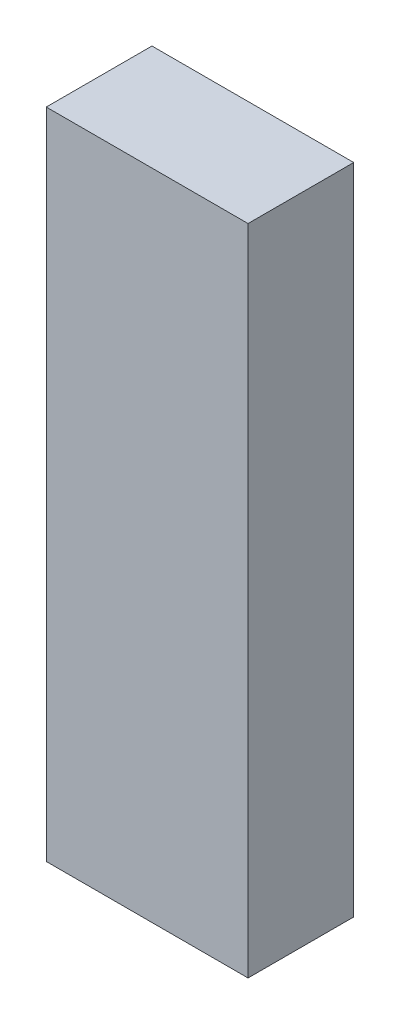
ISO-10303-21;
HEADER;
FILE_DESCRIPTION(('STEP AP214'),'2;1');
FILE_NAME('part.step','',(''),(''),'','','');
FILE_SCHEMA(('AUTOMOTIVE_DESIGN { 1 0 10303 214 1 1 1 1 }'));
ENDSEC;
DATA;
#1=APPLICATION_CONTEXT('core data for automotive mechanical design processes');
#2=APPLICATION_PROTOCOL_DEFINITION('international standard','automotive_design',2000,#1);
#3=PRODUCT_CONTEXT('',#1,'mechanical');
#4=PRODUCT('Part','Part','',(#3));
#5=PRODUCT_RELATED_PRODUCT_CATEGORY('part','',(#4));
#6=PRODUCT_DEFINITION_FORMATION('','',#4);
#7=PRODUCT_DEFINITION_CONTEXT('part definition',#1,'design');
#8=PRODUCT_DEFINITION('design','',#6,#7);
#9=PRODUCT_DEFINITION_SHAPE('','',#8);
#10=(LENGTH_UNIT() NAMED_UNIT(*) SI_UNIT(.MILLI.,.METRE.));
#11=(NAMED_UNIT(*) PLANE_ANGLE_UNIT() SI_UNIT($,.RADIAN.));
#12=(NAMED_UNIT(*) SI_UNIT($,.STERADIAN.) SOLID_ANGLE_UNIT());
#13=UNCERTAINTY_MEASURE_WITH_UNIT(LENGTH_MEASURE(1.E-05),#10,'distance_accuracy_value','');
#14=(GEOMETRIC_REPRESENTATION_CONTEXT(3) GLOBAL_UNCERTAINTY_ASSIGNED_CONTEXT((#13)) GLOBAL_UNIT_ASSIGNED_CONTEXT((#10,
#11,#12)) REPRESENTATION_CONTEXT('',''));
#15=CARTESIAN_POINT('',(0.,0.,0.));
#16=DIRECTION('',(0.,0.,1.));
#17=DIRECTION('',(1.,0.,0.));
#18=AXIS2_PLACEMENT_3D('',#15,#16,#17);
#19=CARTESIAN_POINT('',(21.,136.,11.));
#20=DIRECTION('',(-1.,0.,0.));
#21=DIRECTION('',(0.,0.,1.));
#22=AXIS2_PLACEMENT_3D('',#19,#20,#21);
#23=PLANE('',#22);
#24=DIRECTION('',(0.,0.,-1.));
#25=VECTOR('',#24,1.);
#26=CARTESIAN_POINT('',(21.,0.,11.));
#27=LINE('',#26,#25);
#28=CARTESIAN_POINT('',(21.,0.,11.));
#29=VERTEX_POINT('',#28);
#30=CARTESIAN_POINT('',(21.,0.,-11.));
#31=VERTEX_POINT('',#30);
#32=EDGE_CURVE('E98',#29,#31,#27,.T.);
#33=ORIENTED_EDGE('',*,*,#32,.T.);
#34=DIRECTION('',(0.,-1.,0.));
#35=VECTOR('',#34,1.);
#36=CARTESIAN_POINT('',(21.,136.,-11.));
#37=LINE('',#36,#35);
#38=CARTESIAN_POINT('',(21.,136.,-11.));
#39=VERTEX_POINT('',#38);
#40=EDGE_CURVE('E11',#39,#31,#37,.T.);
#41=ORIENTED_EDGE('',*,*,#40,.F.);
#42=DIRECTION('',(0.,0.,-1.));
#43=VECTOR('',#42,1.);
#44=CARTESIAN_POINT('',(21.,136.,11.));
#45=LINE('',#44,#43);
#46=CARTESIAN_POINT('',(21.,136.,11.));
#47=VERTEX_POINT('',#46);
#48=EDGE_CURVE('E86',#47,#39,#45,.T.);
#49=ORIENTED_EDGE('',*,*,#48,.F.);
#50=DIRECTION('',(0.,-1.,0.));
#51=VECTOR('',#50,1.);
#52=CARTESIAN_POINT('',(21.,136.,11.));
#53=LINE('',#52,#51);
#54=EDGE_CURVE('E94',#47,#29,#53,.T.);
#55=ORIENTED_EDGE('',*,*,#54,.T.);
#56=EDGE_LOOP('',(#33,#41,#49,#55));
#57=FACE_BOUND('',#56,.T.);
#58=ADVANCED_FACE('F35',(#57),#23,.F.);
#59=CARTESIAN_POINT('',(-21.,136.,-11.));
#60=DIRECTION('',(0.,0.,1.));
#61=DIRECTION('',(1.,0.,0.));
#62=AXIS2_PLACEMENT_3D('',#59,#60,#61);
#63=PLANE('',#62);
#64=DIRECTION('',(-1.,0.,0.));
#65=VECTOR('',#64,1.);
#66=CARTESIAN_POINT('',(-21.,0.,-11.));
#67=LINE('',#66,#65);
#68=CARTESIAN_POINT('',(-21.,0.,-11.));
#69=VERTEX_POINT('',#68);
#70=EDGE_CURVE('E90',#31,#69,#67,.T.);
#71=ORIENTED_EDGE('',*,*,#70,.T.);
#72=DIRECTION('',(0.,-1.,0.));
#73=VECTOR('',#72,1.);
#74=CARTESIAN_POINT('',(-21.,136.,-11.));
#75=LINE('',#74,#73);
#76=CARTESIAN_POINT('',(-21.,136.,-11.));
#77=VERTEX_POINT('',#76);
#78=EDGE_CURVE('E43',#77,#69,#75,.T.);
#79=ORIENTED_EDGE('',*,*,#78,.F.);
#80=DIRECTION('',(-1.,0.,0.));
#81=VECTOR('',#80,1.);
#82=CARTESIAN_POINT('',(-21.,136.,-11.));
#83=LINE('',#82,#81);
#84=EDGE_CURVE('E81',#39,#77,#83,.T.);
#85=ORIENTED_EDGE('',*,*,#84,.F.);
#86=ORIENTED_EDGE('',*,*,#40,.T.);
#87=EDGE_LOOP('',(#71,#79,#85,#86));
#88=FACE_BOUND('',#87,.T.);
#89=ADVANCED_FACE('F89',(#88),#63,.F.);
#90=CARTESIAN_POINT('',(-21.,136.,11.));
#91=DIRECTION('',(1.,0.,0.));
#92=DIRECTION('',(0.,0.,-1.));
#93=AXIS2_PLACEMENT_3D('',#90,#91,#92);
#94=PLANE('',#93);
#95=DIRECTION('',(0.,0.,1.));
#96=VECTOR('',#95,1.);
#97=CARTESIAN_POINT('',(-21.,0.,11.));
#98=LINE('',#97,#96);
#99=CARTESIAN_POINT('',(-21.,0.,11.));
#100=VERTEX_POINT('',#99);
#101=EDGE_CURVE('E68',#69,#100,#98,.T.);
#102=ORIENTED_EDGE('',*,*,#101,.T.);
#103=DIRECTION('',(0.,-1.,0.));
#104=VECTOR('',#103,1.);
#105=CARTESIAN_POINT('',(-21.,136.,11.));
#106=LINE('',#105,#104);
#107=CARTESIAN_POINT('',(-21.,136.,11.));
#108=VERTEX_POINT('',#107);
#109=EDGE_CURVE('E91',#108,#100,#106,.T.);
#110=ORIENTED_EDGE('',*,*,#109,.F.);
#111=DIRECTION('',(0.,0.,1.));
#112=VECTOR('',#111,1.);
#113=CARTESIAN_POINT('',(-21.,136.,11.));
#114=LINE('',#113,#112);
#115=EDGE_CURVE('E84',#77,#108,#114,.T.);
#116=ORIENTED_EDGE('',*,*,#115,.F.);
#117=ORIENTED_EDGE('',*,*,#78,.T.);
#118=EDGE_LOOP('',(#102,#110,#116,#117));
#119=FACE_BOUND('',#118,.T.);
#120=ADVANCED_FACE('F92',(#119),#94,.F.);
#121=CARTESIAN_POINT('',(-21.,136.,11.));
#122=DIRECTION('',(0.,0.,-1.));
#123=DIRECTION('',(-1.,0.,0.));
#124=AXIS2_PLACEMENT_3D('',#121,#122,#123);
#125=PLANE('',#124);
#126=DIRECTION('',(1.,0.,0.));
#127=VECTOR('',#126,1.);
#128=CARTESIAN_POINT('',(-21.,0.,11.));
#129=LINE('',#128,#127);
#130=EDGE_CURVE('E74',#100,#29,#129,.T.);
#131=ORIENTED_EDGE('',*,*,#130,.T.);
#132=ORIENTED_EDGE('',*,*,#54,.F.);
#133=DIRECTION('',(1.,0.,0.));
#134=VECTOR('',#133,1.);
#135=CARTESIAN_POINT('',(-21.,136.,11.));
#136=LINE('',#135,#134);
#137=EDGE_CURVE('E51',#108,#47,#136,.T.);
#138=ORIENTED_EDGE('',*,*,#137,.F.);
#139=ORIENTED_EDGE('',*,*,#109,.T.);
#140=EDGE_LOOP('',(#131,#132,#138,#139));
#141=FACE_BOUND('',#140,.T.);
#142=ADVANCED_FACE('F105',(#141),#125,.F.);
#143=CARTESIAN_POINT('',(0.,136.,0.));
#144=DIRECTION('',(0.,-1.,0.));
#145=DIRECTION('',(0.,0.,-1.));
#146=AXIS2_PLACEMENT_3D('',#143,#144,#145);
#147=PLANE('',#146);
#148=ORIENTED_EDGE('',*,*,#48,.T.);
#149=ORIENTED_EDGE('',*,*,#84,.T.);
#150=ORIENTED_EDGE('',*,*,#115,.T.);
#151=ORIENTED_EDGE('',*,*,#137,.T.);
#152=EDGE_LOOP('',(#148,#149,#150,#151));
#153=FACE_BOUND('',#152,.T.);
#154=ADVANCED_FACE('F82',(#153),#147,.F.);
#155=CARTESIAN_POINT('',(0.,0.,0.));
#156=DIRECTION('',(0.,-1.,0.));
#157=DIRECTION('',(0.,0.,-1.));
#158=AXIS2_PLACEMENT_3D('',#155,#156,#157);
#159=PLANE('',#158);
#160=ORIENTED_EDGE('',*,*,#32,.F.);
#161=ORIENTED_EDGE('',*,*,#130,.F.);
#162=ORIENTED_EDGE('',*,*,#101,.F.);
#163=ORIENTED_EDGE('',*,*,#70,.F.);
#164=EDGE_LOOP('',(#160,#161,#162,#163));
#165=FACE_BOUND('',#164,.T.);
#166=ADVANCED_FACE('F108',(#165),#159,.T.);
#167=CLOSED_SHELL('',(#58,#89,#120,#142,#154,#166));
#168=MANIFOLD_SOLID_BREP('B2',#167);
#169=ADVANCED_BREP_SHAPE_REPRESENTATION('',(#18,#168),#14);
#170=SHAPE_DEFINITION_REPRESENTATION(#9,#169);
ENDSEC;
END-ISO-10303-21;
